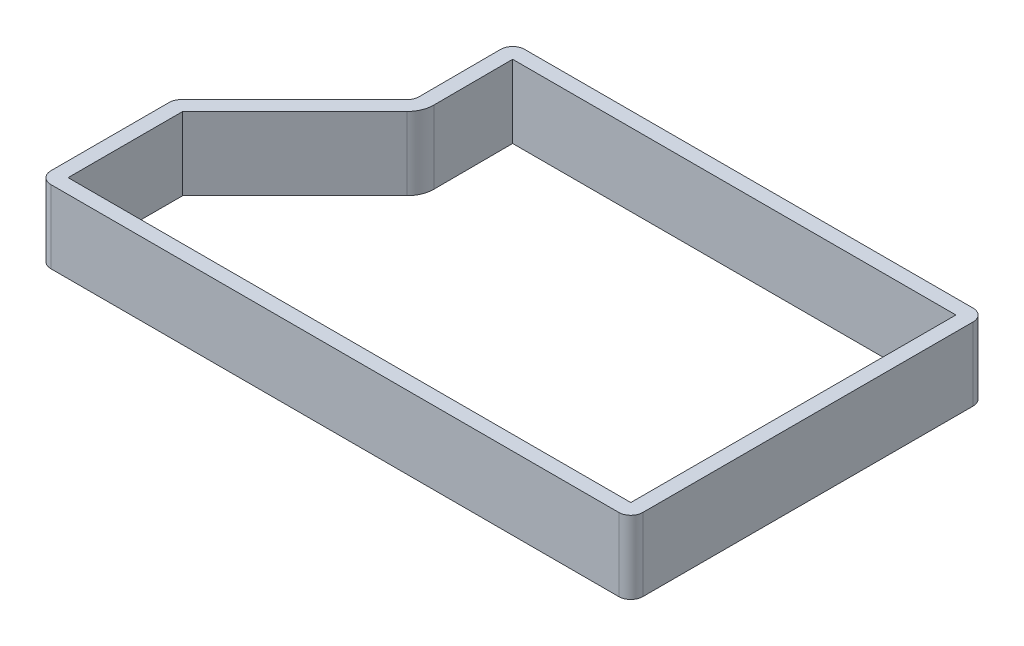
ISO-10303-21;
HEADER;
FILE_DESCRIPTION(('STEP AP214'),'2;1');
FILE_NAME('part.step','',(''),(''),'','','');
FILE_SCHEMA(('AUTOMOTIVE_DESIGN { 1 0 10303 214 1 1 1 1 }'));
ENDSEC;
DATA;
#1=APPLICATION_CONTEXT('core data for automotive mechanical design processes');
#2=APPLICATION_PROTOCOL_DEFINITION('international standard','automotive_design',2000,#1);
#3=PRODUCT_CONTEXT('',#1,'mechanical');
#4=PRODUCT('Part','Part','',(#3));
#5=PRODUCT_RELATED_PRODUCT_CATEGORY('part','',(#4));
#6=PRODUCT_DEFINITION_FORMATION('','',#4);
#7=PRODUCT_DEFINITION_CONTEXT('part definition',#1,'design');
#8=PRODUCT_DEFINITION('design','',#6,#7);
#9=PRODUCT_DEFINITION_SHAPE('','',#8);
#10=(LENGTH_UNIT() NAMED_UNIT(*) SI_UNIT(.MILLI.,.METRE.));
#11=(NAMED_UNIT(*) PLANE_ANGLE_UNIT() SI_UNIT($,.RADIAN.));
#12=(NAMED_UNIT(*) SI_UNIT($,.STERADIAN.) SOLID_ANGLE_UNIT());
#13=UNCERTAINTY_MEASURE_WITH_UNIT(LENGTH_MEASURE(1.E-05),#10,'distance_accuracy_value','');
#14=(GEOMETRIC_REPRESENTATION_CONTEXT(3) GLOBAL_UNCERTAINTY_ASSIGNED_CONTEXT((#13)) GLOBAL_UNIT_ASSIGNED_CONTEXT((#10,
#11,#12)) REPRESENTATION_CONTEXT('',''));
#15=CARTESIAN_POINT('',(0.,0.,0.));
#16=DIRECTION('',(0.,0.,1.));
#17=DIRECTION('',(1.,0.,0.));
#18=AXIS2_PLACEMENT_3D('',#15,#16,#17);
#19=CARTESIAN_POINT('',(-46.4052124173838,10.,20.5894095757332));
#20=DIRECTION('',(0.,1.,0.));
#21=DIRECTION('',(0.,0.,1.));
#22=AXIS2_PLACEMENT_3D('',#19,#20,#21);
#23=PLANE('',#22);
#24=CARTESIAN_POINT('',(-46.4052124173838,10.,20.5894095757332));
#25=DIRECTION('',(0.,1.,0.));
#26=DIRECTION('',(0.,0.,1.));
#27=AXIS2_PLACEMENT_3D('',#24,#25,#26);
#28=CIRCLE('',#27,1.65000064514463);
#29=CARTESIAN_POINT('',(-48.0552130625284,10.,20.5894095757332));
#30=VERTEX_POINT('',#29);
#31=CARTESIAN_POINT('',(-46.4052102955138,10.,22.2394102208765));
#32=VERTEX_POINT('',#31);
#33=EDGE_CURVE('E283',#30,#32,#28,.T.);
#34=ORIENTED_EDGE('',*,*,#33,.T.);
#35=DIRECTION('',(0.999999999999173,0.,-1.28598131570497E-06));
#36=VECTOR('',#35,1.);
#37=CARTESIAN_POINT('',(-46.4052102955138,10.,22.2394102208765));
#38=LINE('',#37,#36);
#39=CARTESIAN_POINT('',(31.4341775141972,10.,22.2393101208781));
#40=VERTEX_POINT('',#39);
#41=EDGE_CURVE('E286',#32,#40,#38,.T.);
#42=ORIENTED_EDGE('',*,*,#41,.T.);
#43=CARTESIAN_POINT('',(31.4341753923272,10.,20.5893094757404));
#44=DIRECTION('',(0.,1.,0.));
#45=DIRECTION('',(0.,0.,1.));
#46=AXIS2_PLACEMENT_3D('',#43,#44,#45);
#47=CIRCLE('',#46,1.65000064513913);
#48=CARTESIAN_POINT('',(33.0841758904115,10.,20.5900060970397));
#49=VERTEX_POINT('',#48);
#50=EDGE_CURVE('E289',#40,#49,#47,.T.);
#51=ORIENTED_EDGE('',*,*,#50,.T.);
#52=DIRECTION('',(0.000422194561797054,0.,-0.999999910875872));
#53=VECTOR('',#52,1.);
#54=CARTESIAN_POINT('',(33.0841758904115,10.,20.5900060970397));
#55=LINE('',#54,#53);
#56=CARTESIAN_POINT('',(33.1032787836854,10.,-24.6566486445435));
#57=VERTEX_POINT('',#56);
#58=EDGE_CURVE('E291',#49,#57,#55,.T.);
#59=ORIENTED_EDGE('',*,*,#58,.T.);
#60=CARTESIAN_POINT('',(31.4532777506671,10.,-24.6573452647848));
#61=DIRECTION('',(0.,1.,0.));
#62=DIRECTION('',(0.,0.,1.));
#63=AXIS2_PLACEMENT_3D('',#60,#61,#62);
#64=CIRCLE('',#63,1.65000118007266);
#65=CARTESIAN_POINT('',(31.4526034062025,10.,-26.3073463070574));
#66=VERTEX_POINT('',#65);
#67=EDGE_CURVE('E293',#57,#66,#64,.T.);
#68=ORIENTED_EDGE('',*,*,#67,.T.);
#69=DIRECTION('',(-0.999999916521232,0.,0.000408604368280507));
#70=VECTOR('',#69,1.);
#71=CARTESIAN_POINT('',(31.4526034062025,10.,-26.3073463070574));
#72=LINE('',#71,#70);
#73=CARTESIAN_POINT('',(-29.9917370350299,10.,-26.2822398790512));
#74=VERTEX_POINT('',#73);
#75=EDGE_CURVE('E295',#66,#74,#72,.T.);
#76=ORIENTED_EDGE('',*,*,#75,.T.);
#77=CARTESIAN_POINT('',(-29.9910628351832,10.,-24.6322335582128));
#78=DIRECTION('',(0.,1.,0.));
#79=DIRECTION('',(0.,0.,1.));
#80=AXIS2_PLACEMENT_3D('',#77,#78,#79);
#81=CIRCLE('',#80,1.65000645857893);
#82=CARTESIAN_POINT('',(-31.6395907625583,10.,-24.7020689791437));
#83=VERTEX_POINT('',#82);
#84=EDGE_CURVE('E297',#74,#83,#81,.T.);
#85=ORIENTED_EDGE('',*,*,#84,.T.);
#86=DIRECTION('',(0.00333069762771936,0.,0.999994453211273));
#87=VECTOR('',#86,1.);
#88=CARTESIAN_POINT('',(-31.6395907625583,10.,-24.7020689791437));
#89=LINE('',#88,#87);
#90=CARTESIAN_POINT('',(-31.6020928625583,10.,-13.4438593791436));
#91=VERTEX_POINT('',#90);
#92=EDGE_CURVE('E299',#83,#91,#89,.T.);
#93=ORIENTED_EDGE('',*,*,#92,.T.);
#94=CARTESIAN_POINT('',(-33.252073423474,10.,-13.4383602646437));
#95=DIRECTION('',(0.,-1.,0.));
#96=DIRECTION('',(0.,0.,1.));
#97=AXIS2_PLACEMENT_3D('',#94,#95,#96);
#98=CIRCLE('',#97,1.64998972471343);
#99=CARTESIAN_POINT('',(-32.085354500241,10.,-12.2716413414107));
#100=VERTEX_POINT('',#99);
#101=EDGE_CURVE('E301',#91,#100,#98,.T.);
#102=ORIENTED_EDGE('',*,*,#101,.T.);
#103=DIRECTION('',(-0.707106781186548,0.,0.707106781186547));
#104=VECTOR('',#103,1.);
#105=CARTESIAN_POINT('',(-32.085354500241,10.,-12.2716413414107));
#106=LINE('',#105,#104);
#107=CARTESIAN_POINT('',(-47.571938463949,10.,3.2149426222973));
#108=VERTEX_POINT('',#107);
#109=EDGE_CURVE('E303',#100,#108,#106,.T.);
#110=ORIENTED_EDGE('',*,*,#109,.T.);
#111=CARTESIAN_POINT('',(-46.405210373708,10.,4.38167071253824));
#112=DIRECTION('',(0.,1.,0.));
#113=DIRECTION('',(0.,0.,1.));
#114=AXIS2_PLACEMENT_3D('',#111,#112,#113);
#115=CIRCLE('',#114,1.6500026888204);
#116=CARTESIAN_POINT('',(-48.0552130625284,10.,4.38167071253824));
#117=VERTEX_POINT('',#116);
#118=EDGE_CURVE('E305',#108,#117,#115,.T.);
#119=ORIENTED_EDGE('',*,*,#118,.T.);
#120=DIRECTION('',(0.,0.,1.));
#121=VECTOR('',#120,1.);
#122=CARTESIAN_POINT('',(-48.0552130625284,10.,4.38167071253824));
#123=LINE('',#122,#121);
#124=EDGE_CURVE('E307',#117,#30,#123,.T.);
#125=ORIENTED_EDGE('',*,*,#124,.T.);
#126=EDGE_LOOP('',(#34,#42,#51,#59,#68,#76,#85,#93,#102,#110,#119,#125));
#127=FACE_BOUND('',#126,.T.);
#128=DIRECTION('',(0.000422194561797054,0.,-0.999999910875872));
#129=VECTOR('',#128,1.);
#130=CARTESIAN_POINT('',(31.0841760686597,10.,20.5891617079161));
#131=LINE('',#130,#129);
#132=CARTESIAN_POINT('',(31.0843237739204,10.,20.2393105707819));
#133=VERTEX_POINT('',#132);
#134=CARTESIAN_POINT('',(31.1031310715185,10.,-24.3072033441654));
#135=VERTEX_POINT('',#134);
#136=EDGE_CURVE('E233',#133,#135,#131,.T.);
#137=ORIENTED_EDGE('',*,*,#136,.F.);
#138=DIRECTION('',(0.999999999999173,0.,-1.28598131570497E-06));
#139=VECTOR('',#138,1.);
#140=CARTESIAN_POINT('',(-46.4052128674764,10.,20.2394102208782));
#141=LINE('',#140,#139);
#142=CARTESIAN_POINT('',(-46.0552130625284,10.,20.2394097707849));
#143=VERTEX_POINT('',#142);
#144=EDGE_CURVE('E225',#143,#133,#141,.T.);
#145=ORIENTED_EDGE('',*,*,#144,.F.);
#146=DIRECTION('',(0.,0.,1.));
#147=VECTOR('',#146,1.);
#148=CARTESIAN_POINT('',(-46.0552130625284,10.,4.38167071253824));
#149=LINE('',#148,#147);
#150=CARTESIAN_POINT('',(-46.0552130625284,10.,4.52664434562294));
#151=VERTEX_POINT('',#150);
#152=EDGE_CURVE('E256',#151,#143,#149,.T.);
#153=ORIENTED_EDGE('',*,*,#152,.F.);
#154=DIRECTION('',(-0.707106781186548,0.,0.707106781186547));
#155=VECTOR('',#154,1.);
#156=CARTESIAN_POINT('',(-30.6711409378679,10.,-10.8574277790376));
#157=LINE('',#156,#155);
#158=CARTESIAN_POINT('',(-30.6711409378679,10.,-10.8574277790376));
#159=VERTEX_POINT('',#158);
#160=EDGE_CURVE('E254',#159,#151,#157,.T.);
#161=ORIENTED_EDGE('',*,*,#160,.F.);
#162=CARTESIAN_POINT('',(-33.252073423474,10.,-13.4383602646437));
#163=DIRECTION('',(0.,1.,0.));
#164=DIRECTION('',(1.,0.,0.));
#165=AXIS2_PLACEMENT_3D('',#162,#163,#164);
#166=CIRCLE('',#165,3.64998972471343);
#167=CARTESIAN_POINT('',(-29.6021039561357,10.,-13.4505207743991));
#168=VERTEX_POINT('',#167);
#169=EDGE_CURVE('E252',#168,#159,#166,.F.);
#170=ORIENTED_EDGE('',*,*,#169,.F.);
#171=DIRECTION('',(0.00333069762771936,0.,0.999994453211273));
#172=VECTOR('',#171,1.);
#173=CARTESIAN_POINT('',(-29.6396018561358,10.,-24.7087303743991));
#174=LINE('',#173,#172);
#175=CARTESIAN_POINT('',(-29.6381818179885,10.,-24.2823841763118));
#176=VERTEX_POINT('',#175);
#177=EDGE_CURVE('E248',#176,#168,#174,.T.);
#178=ORIENTED_EDGE('',*,*,#177,.F.);
#179=DIRECTION('',(-0.999999916521232,0.,0.000408604368280507));
#180=VECTOR('',#179,1.);
#181=CARTESIAN_POINT('',(31.4534206149391,10.,-24.307346474015));
#182=LINE('',#181,#180);
#183=EDGE_CURVE('E246',#135,#176,#182,.T.);
#184=ORIENTED_EDGE('',*,*,#183,.F.);
#185=EDGE_LOOP('',(#137,#145,#153,#161,#170,#178,#184));
#186=FACE_BOUND('',#185,.T.);
#187=ADVANCED_FACE('F94',(#127,#186),#23,.T.);
#188=CARTESIAN_POINT('',(-46.4052124173838,0.,20.5894095757332));
#189=DIRECTION('',(0.,1.,0.));
#190=DIRECTION('',(0.,0.,1.));
#191=AXIS2_PLACEMENT_3D('',#188,#189,#190);
#192=PLANE('',#191);
#193=CARTESIAN_POINT('',(-46.4052124173838,0.,20.5894095757332));
#194=DIRECTION('',(0.,1.,0.));
#195=DIRECTION('',(0.,0.,1.));
#196=AXIS2_PLACEMENT_3D('',#193,#194,#195);
#197=CIRCLE('',#196,1.65000064514463);
#198=CARTESIAN_POINT('',(-48.0552130625284,0.,20.5894095757332));
#199=VERTEX_POINT('',#198);
#200=CARTESIAN_POINT('',(-46.4052102955138,0.,22.2394102208765));
#201=VERTEX_POINT('',#200);
#202=EDGE_CURVE('E241',#199,#201,#197,.T.);
#203=ORIENTED_EDGE('',*,*,#202,.F.);
#204=DIRECTION('',(0.,0.,1.));
#205=VECTOR('',#204,1.);
#206=CARTESIAN_POINT('',(-48.0552130625284,0.,4.38167071253824));
#207=LINE('',#206,#205);
#208=CARTESIAN_POINT('',(-48.0552130625284,0.,4.38167071253824));
#209=VERTEX_POINT('',#208);
#210=EDGE_CURVE('E287',#209,#199,#207,.T.);
#211=ORIENTED_EDGE('',*,*,#210,.F.);
#212=CARTESIAN_POINT('',(-46.405210373708,0.,4.38167071253824));
#213=DIRECTION('',(0.,1.,0.));
#214=DIRECTION('',(0.,0.,1.));
#215=AXIS2_PLACEMENT_3D('',#212,#213,#214);
#216=CIRCLE('',#215,1.6500026888204);
#217=CARTESIAN_POINT('',(-47.571938463949,0.,3.2149426222973));
#218=VERTEX_POINT('',#217);
#219=EDGE_CURVE('E330',#218,#209,#216,.T.);
#220=ORIENTED_EDGE('',*,*,#219,.F.);
#221=DIRECTION('',(-0.707106781186548,0.,0.707106781186547));
#222=VECTOR('',#221,1.);
#223=CARTESIAN_POINT('',(-32.085354500241,0.,-12.2716413414107));
#224=LINE('',#223,#222);
#225=CARTESIAN_POINT('',(-32.085354500241,0.,-12.2716413414107));
#226=VERTEX_POINT('',#225);
#227=EDGE_CURVE('E328',#226,#218,#224,.T.);
#228=ORIENTED_EDGE('',*,*,#227,.F.);
#229=CARTESIAN_POINT('',(-33.252073423474,0.,-13.4383602646437));
#230=DIRECTION('',(0.,-1.,0.));
#231=DIRECTION('',(0.,0.,1.));
#232=AXIS2_PLACEMENT_3D('',#229,#230,#231);
#233=CIRCLE('',#232,1.64998972471343);
#234=CARTESIAN_POINT('',(-31.6020928625583,0.,-13.4438593791436));
#235=VERTEX_POINT('',#234);
#236=EDGE_CURVE('E326',#235,#226,#233,.T.);
#237=ORIENTED_EDGE('',*,*,#236,.F.);
#238=DIRECTION('',(0.00333069762771936,0.,0.999994453211273));
#239=VECTOR('',#238,1.);
#240=CARTESIAN_POINT('',(-31.6395907625583,0.,-24.7020689791437));
#241=LINE('',#240,#239);
#242=CARTESIAN_POINT('',(-31.6395907625583,0.,-24.7020689791437));
#243=VERTEX_POINT('',#242);
#244=EDGE_CURVE('E324',#243,#235,#241,.T.);
#245=ORIENTED_EDGE('',*,*,#244,.F.);
#246=CARTESIAN_POINT('',(-29.9910628351832,0.,-24.6322335582128));
#247=DIRECTION('',(0.,1.,0.));
#248=DIRECTION('',(0.,0.,1.));
#249=AXIS2_PLACEMENT_3D('',#246,#247,#248);
#250=CIRCLE('',#249,1.65000645857893);
#251=CARTESIAN_POINT('',(-29.9917370350299,0.,-26.2822398790512));
#252=VERTEX_POINT('',#251);
#253=EDGE_CURVE('E322',#252,#243,#250,.T.);
#254=ORIENTED_EDGE('',*,*,#253,.F.);
#255=DIRECTION('',(-0.999999916521232,0.,0.000408604368280507));
#256=VECTOR('',#255,1.);
#257=CARTESIAN_POINT('',(31.4526034062025,0.,-26.3073463070574));
#258=LINE('',#257,#256);
#259=CARTESIAN_POINT('',(31.4526034062025,0.,-26.3073463070574));
#260=VERTEX_POINT('',#259);
#261=EDGE_CURVE('E320',#260,#252,#258,.T.);
#262=ORIENTED_EDGE('',*,*,#261,.F.);
#263=CARTESIAN_POINT('',(31.4532777506671,0.,-24.6573452647848));
#264=DIRECTION('',(0.,1.,0.));
#265=DIRECTION('',(0.,0.,1.));
#266=AXIS2_PLACEMENT_3D('',#263,#264,#265);
#267=CIRCLE('',#266,1.65000118007266);
#268=CARTESIAN_POINT('',(33.1032787836854,0.,-24.6566486445435));
#269=VERTEX_POINT('',#268);
#270=EDGE_CURVE('E318',#269,#260,#267,.T.);
#271=ORIENTED_EDGE('',*,*,#270,.F.);
#272=DIRECTION('',(0.000422194561797054,0.,-0.999999910875872));
#273=VECTOR('',#272,1.);
#274=CARTESIAN_POINT('',(33.0841758904115,0.,20.5900060970397));
#275=LINE('',#274,#273);
#276=CARTESIAN_POINT('',(33.0841758904115,0.,20.5900060970397));
#277=VERTEX_POINT('',#276);
#278=EDGE_CURVE('E316',#277,#269,#275,.T.);
#279=ORIENTED_EDGE('',*,*,#278,.F.);
#280=CARTESIAN_POINT('',(31.4341753923272,0.,20.5893094757404));
#281=DIRECTION('',(0.,1.,0.));
#282=DIRECTION('',(0.,0.,1.));
#283=AXIS2_PLACEMENT_3D('',#280,#281,#282);
#284=CIRCLE('',#283,1.65000064513913);
#285=CARTESIAN_POINT('',(31.4341775141972,0.,22.2393101208781));
#286=VERTEX_POINT('',#285);
#287=EDGE_CURVE('E314',#286,#277,#284,.T.);
#288=ORIENTED_EDGE('',*,*,#287,.F.);
#289=DIRECTION('',(0.999999999999173,0.,-1.28598131570497E-06));
#290=VECTOR('',#289,1.);
#291=CARTESIAN_POINT('',(-46.4052102955138,0.,22.2394102208765));
#292=LINE('',#291,#290);
#293=EDGE_CURVE('E312',#201,#286,#292,.T.);
#294=ORIENTED_EDGE('',*,*,#293,.F.);
#295=EDGE_LOOP('',(#203,#211,#220,#228,#237,#245,#254,#262,#271,#279,#288,#294));
#296=FACE_BOUND('',#295,.T.);
#297=DIRECTION('',(0.999999999999173,0.,-1.28598131570497E-06));
#298=VECTOR('',#297,1.);
#299=CARTESIAN_POINT('',(-46.4052128674764,0.,20.2394102208782));
#300=LINE('',#299,#298);
#301=CARTESIAN_POINT('',(-46.0552130625284,0.,20.2394097707849));
#302=VERTEX_POINT('',#301);
#303=CARTESIAN_POINT('',(31.0843237739204,0.,20.2393105707819));
#304=VERTEX_POINT('',#303);
#305=EDGE_CURVE('E117',#302,#304,#300,.T.);
#306=ORIENTED_EDGE('',*,*,#305,.T.);
#307=DIRECTION('',(0.000422194561797054,0.,-0.999999910875872));
#308=VECTOR('',#307,1.);
#309=CARTESIAN_POINT('',(31.0841760686597,0.,20.5891617079161));
#310=LINE('',#309,#308);
#311=CARTESIAN_POINT('',(31.1031310715185,0.,-24.3072033441654));
#312=VERTEX_POINT('',#311);
#313=EDGE_CURVE('E240',#304,#312,#310,.T.);
#314=ORIENTED_EDGE('',*,*,#313,.T.);
#315=DIRECTION('',(-0.999999916521232,0.,0.000408604368280507));
#316=VECTOR('',#315,1.);
#317=CARTESIAN_POINT('',(31.4534206149391,0.,-24.307346474015));
#318=LINE('',#317,#316);
#319=CARTESIAN_POINT('',(-29.6381818179885,0.,-24.2823841763118));
#320=VERTEX_POINT('',#319);
#321=EDGE_CURVE('E260',#312,#320,#318,.T.);
#322=ORIENTED_EDGE('',*,*,#321,.T.);
#323=DIRECTION('',(0.00333069762771936,0.,0.999994453211273));
#324=VECTOR('',#323,1.);
#325=CARTESIAN_POINT('',(-29.6396018561358,0.,-24.7087303743991));
#326=LINE('',#325,#324);
#327=CARTESIAN_POINT('',(-29.6021039561357,0.,-13.4505207743991));
#328=VERTEX_POINT('',#327);
#329=EDGE_CURVE('E263',#320,#328,#326,.T.);
#330=ORIENTED_EDGE('',*,*,#329,.T.);
#331=CARTESIAN_POINT('',(-33.252073423474,0.,-13.4383602646437));
#332=DIRECTION('',(0.,1.,0.));
#333=DIRECTION('',(1.,0.,0.));
#334=AXIS2_PLACEMENT_3D('',#331,#332,#333);
#335=CIRCLE('',#334,3.64998972471343);
#336=CARTESIAN_POINT('',(-30.6711409378679,0.,-10.8574277790376));
#337=VERTEX_POINT('',#336);
#338=EDGE_CURVE('E266',#328,#337,#335,.F.);
#339=ORIENTED_EDGE('',*,*,#338,.T.);
#340=DIRECTION('',(-0.707106781186548,0.,0.707106781186547));
#341=VECTOR('',#340,1.);
#342=CARTESIAN_POINT('',(-30.6711409378679,0.,-10.8574277790376));
#343=LINE('',#342,#341);
#344=CARTESIAN_POINT('',(-46.0552130625284,0.,4.52664434562294));
#345=VERTEX_POINT('',#344);
#346=EDGE_CURVE('E269',#337,#345,#343,.T.);
#347=ORIENTED_EDGE('',*,*,#346,.T.);
#348=DIRECTION('',(0.,0.,1.));
#349=VECTOR('',#348,1.);
#350=CARTESIAN_POINT('',(-46.0552130625284,0.,4.38167071253824));
#351=LINE('',#350,#349);
#352=EDGE_CURVE('E234',#345,#302,#351,.T.);
#353=ORIENTED_EDGE('',*,*,#352,.T.);
#354=EDGE_LOOP('',(#306,#314,#322,#330,#339,#347,#353));
#355=FACE_BOUND('',#354,.T.);
#356=ADVANCED_FACE('F372',(#296,#355),#192,.F.);
#357=CARTESIAN_POINT('',(-46.4052124173838,10.,20.5894095757332));
#358=DIRECTION('',(0.,-1.,0.));
#359=DIRECTION('',(0.,0.,-1.));
#360=AXIS2_PLACEMENT_3D('',#357,#358,#359);
#361=CYLINDRICAL_SURFACE('',#360,1.65000064514463);
#362=ORIENTED_EDGE('',*,*,#202,.T.);
#363=DIRECTION('',(0.,-1.,0.));
#364=VECTOR('',#363,1.);
#365=CARTESIAN_POINT('',(-46.4052102955138,10.,22.2394102208765));
#366=LINE('',#365,#364);
#367=EDGE_CURVE('E12',#32,#201,#366,.T.);
#368=ORIENTED_EDGE('',*,*,#367,.F.);
#369=ORIENTED_EDGE('',*,*,#33,.F.);
#370=DIRECTION('',(0.,-1.,0.));
#371=VECTOR('',#370,1.);
#372=CARTESIAN_POINT('',(-48.0552130625284,10.,20.5894095757332));
#373=LINE('',#372,#371);
#374=EDGE_CURVE('E309',#30,#199,#373,.T.);
#375=ORIENTED_EDGE('',*,*,#374,.T.);
#376=EDGE_LOOP('',(#362,#368,#369,#375));
#377=FACE_BOUND('',#376,.T.);
#378=ADVANCED_FACE('F96',(#377),#361,.T.);
#379=CARTESIAN_POINT('',(-46.4052102955138,10.,22.2394102208765));
#380=DIRECTION('',(-1.28598131570497E-06,0.,-0.999999999999173));
#381=DIRECTION('',(-0.999999999999173,0.,1.28598131570497E-06));
#382=AXIS2_PLACEMENT_3D('',#379,#380,#381);
#383=PLANE('',#382);
#384=ORIENTED_EDGE('',*,*,#293,.T.);
#385=DIRECTION('',(0.,-1.,0.));
#386=VECTOR('',#385,1.);
#387=CARTESIAN_POINT('',(31.4341775141972,10.,22.2393101208781));
#388=LINE('',#387,#386);
#389=EDGE_CURVE('E102',#40,#286,#388,.T.);
#390=ORIENTED_EDGE('',*,*,#389,.F.);
#391=ORIENTED_EDGE('',*,*,#41,.F.);
#392=ORIENTED_EDGE('',*,*,#367,.T.);
#393=EDGE_LOOP('',(#384,#390,#391,#392));
#394=FACE_BOUND('',#393,.T.);
#395=ADVANCED_FACE('F389',(#394),#383,.F.);
#396=CARTESIAN_POINT('',(31.4341753923272,10.,20.5893094757404));
#397=DIRECTION('',(0.,-1.,0.));
#398=DIRECTION('',(0.,0.,-1.));
#399=AXIS2_PLACEMENT_3D('',#396,#397,#398);
#400=CYLINDRICAL_SURFACE('',#399,1.65000064513913);
#401=ORIENTED_EDGE('',*,*,#287,.T.);
#402=DIRECTION('',(0.,-1.,0.));
#403=VECTOR('',#402,1.);
#404=CARTESIAN_POINT('',(33.0841758904115,10.,20.5900060970397));
#405=LINE('',#404,#403);
#406=EDGE_CURVE('E359',#49,#277,#405,.T.);
#407=ORIENTED_EDGE('',*,*,#406,.F.);
#408=ORIENTED_EDGE('',*,*,#50,.F.);
#409=ORIENTED_EDGE('',*,*,#389,.T.);
#410=EDGE_LOOP('',(#401,#407,#408,#409));
#411=FACE_BOUND('',#410,.T.);
#412=ADVANCED_FACE('F366',(#411),#400,.T.);
#413=CARTESIAN_POINT('',(33.0841758904115,10.,20.5900060970397));
#414=DIRECTION('',(-0.999999910875872,0.,-0.000422194561797053));
#415=DIRECTION('',(-0.000422194561797054,0.,0.999999910875872));
#416=AXIS2_PLACEMENT_3D('',#413,#414,#415);
#417=PLANE('',#416);
#418=ORIENTED_EDGE('',*,*,#278,.T.);
#419=DIRECTION('',(0.,-1.,0.));
#420=VECTOR('',#419,1.);
#421=CARTESIAN_POINT('',(33.1032787836854,10.,-24.6566486445435));
#422=LINE('',#421,#420);
#423=EDGE_CURVE('E356',#57,#269,#422,.T.);
#424=ORIENTED_EDGE('',*,*,#423,.F.);
#425=ORIENTED_EDGE('',*,*,#58,.F.);
#426=ORIENTED_EDGE('',*,*,#406,.T.);
#427=EDGE_LOOP('',(#418,#424,#425,#426));
#428=FACE_BOUND('',#427,.T.);
#429=ADVANCED_FACE('F378',(#428),#417,.F.);
#430=CARTESIAN_POINT('',(31.4532777506671,10.,-24.6573452647848));
#431=DIRECTION('',(0.,-1.,0.));
#432=DIRECTION('',(0.,0.,-1.));
#433=AXIS2_PLACEMENT_3D('',#430,#431,#432);
#434=CYLINDRICAL_SURFACE('',#433,1.65000118007266);
#435=ORIENTED_EDGE('',*,*,#270,.T.);
#436=DIRECTION('',(0.,-1.,0.));
#437=VECTOR('',#436,1.);
#438=CARTESIAN_POINT('',(31.4526034062025,10.,-26.3073463070574));
#439=LINE('',#438,#437);
#440=EDGE_CURVE('E353',#66,#260,#439,.T.);
#441=ORIENTED_EDGE('',*,*,#440,.F.);
#442=ORIENTED_EDGE('',*,*,#67,.F.);
#443=ORIENTED_EDGE('',*,*,#423,.T.);
#444=EDGE_LOOP('',(#435,#441,#442,#443));
#445=FACE_BOUND('',#444,.T.);
#446=ADVANCED_FACE('F382',(#445),#434,.T.);
#447=CARTESIAN_POINT('',(31.4526034062025,10.,-26.3073463070574));
#448=DIRECTION('',(0.000408604368280507,0.,0.999999916521232));
#449=DIRECTION('',(0.999999916521232,0.,-0.000408604368280507));
#450=AXIS2_PLACEMENT_3D('',#447,#448,#449);
#451=PLANE('',#450);
#452=ORIENTED_EDGE('',*,*,#261,.T.);
#453=DIRECTION('',(0.,-1.,0.));
#454=VECTOR('',#453,1.);
#455=CARTESIAN_POINT('',(-29.9917370350299,10.,-26.2822398790512));
#456=LINE('',#455,#454);
#457=EDGE_CURVE('E350',#74,#252,#456,.T.);
#458=ORIENTED_EDGE('',*,*,#457,.F.);
#459=ORIENTED_EDGE('',*,*,#75,.F.);
#460=ORIENTED_EDGE('',*,*,#440,.T.);
#461=EDGE_LOOP('',(#452,#458,#459,#460));
#462=FACE_BOUND('',#461,.T.);
#463=ADVANCED_FACE('F422',(#462),#451,.F.);
#464=CARTESIAN_POINT('',(-29.9910628351832,10.,-24.6322335582128));
#465=DIRECTION('',(0.,-1.,0.));
#466=DIRECTION('',(0.,0.,-1.));
#467=AXIS2_PLACEMENT_3D('',#464,#465,#466);
#468=CYLINDRICAL_SURFACE('',#467,1.65000645857893);
#469=ORIENTED_EDGE('',*,*,#253,.T.);
#470=DIRECTION('',(0.,-1.,0.));
#471=VECTOR('',#470,1.);
#472=CARTESIAN_POINT('',(-31.6395907625583,10.,-24.7020689791437));
#473=LINE('',#472,#471);
#474=EDGE_CURVE('E347',#83,#243,#473,.T.);
#475=ORIENTED_EDGE('',*,*,#474,.F.);
#476=ORIENTED_EDGE('',*,*,#84,.F.);
#477=ORIENTED_EDGE('',*,*,#457,.T.);
#478=EDGE_LOOP('',(#469,#475,#476,#477));
#479=FACE_BOUND('',#478,.T.);
#480=ADVANCED_FACE('F420',(#479),#468,.T.);
#481=CARTESIAN_POINT('',(-31.6395907625583,10.,-24.7020689791437));
#482=DIRECTION('',(0.999994453211273,0.,-0.00333069762771936));
#483=DIRECTION('',(-0.00333069762771936,0.,-0.999994453211273));
#484=AXIS2_PLACEMENT_3D('',#481,#482,#483);
#485=PLANE('',#484);
#486=ORIENTED_EDGE('',*,*,#244,.T.);
#487=DIRECTION('',(0.,-1.,0.));
#488=VECTOR('',#487,1.);
#489=CARTESIAN_POINT('',(-31.6020928625583,10.,-13.4438593791436));
#490=LINE('',#489,#488);
#491=EDGE_CURVE('E344',#91,#235,#490,.T.);
#492=ORIENTED_EDGE('',*,*,#491,.F.);
#493=ORIENTED_EDGE('',*,*,#92,.F.);
#494=ORIENTED_EDGE('',*,*,#474,.T.);
#495=EDGE_LOOP('',(#486,#492,#493,#494));
#496=FACE_BOUND('',#495,.T.);
#497=ADVANCED_FACE('F416',(#496),#485,.F.);
#498=CARTESIAN_POINT('',(-33.252073423474,10.,-13.4383602646437));
#499=DIRECTION('',(0.,-1.,0.));
#500=DIRECTION('',(0.,0.,-1.));
#501=AXIS2_PLACEMENT_3D('',#498,#499,#500);
#502=CYLINDRICAL_SURFACE('',#501,1.64998972471343);
#503=ORIENTED_EDGE('',*,*,#236,.T.);
#504=DIRECTION('',(0.,-1.,0.));
#505=VECTOR('',#504,1.);
#506=CARTESIAN_POINT('',(-32.085354500241,10.,-12.2716413414107));
#507=LINE('',#506,#505);
#508=EDGE_CURVE('E341',#100,#226,#507,.T.);
#509=ORIENTED_EDGE('',*,*,#508,.F.);
#510=ORIENTED_EDGE('',*,*,#101,.F.);
#511=ORIENTED_EDGE('',*,*,#491,.T.);
#512=EDGE_LOOP('',(#503,#509,#510,#511));
#513=FACE_BOUND('',#512,.T.);
#514=ADVANCED_FACE('F411',(#513),#502,.F.);
#515=CARTESIAN_POINT('',(-32.085354500241,10.,-12.2716413414107));
#516=DIRECTION('',(0.707106781186547,0.,0.707106781186548));
#517=DIRECTION('',(0.707106781186548,0.,-0.707106781186547));
#518=AXIS2_PLACEMENT_3D('',#515,#516,#517);
#519=PLANE('',#518);
#520=ORIENTED_EDGE('',*,*,#227,.T.);
#521=DIRECTION('',(0.,-1.,0.));
#522=VECTOR('',#521,1.);
#523=CARTESIAN_POINT('',(-47.571938463949,10.,3.2149426222973));
#524=LINE('',#523,#522);
#525=EDGE_CURVE('E338',#108,#218,#524,.T.);
#526=ORIENTED_EDGE('',*,*,#525,.F.);
#527=ORIENTED_EDGE('',*,*,#109,.F.);
#528=ORIENTED_EDGE('',*,*,#508,.T.);
#529=EDGE_LOOP('',(#520,#526,#527,#528));
#530=FACE_BOUND('',#529,.T.);
#531=ADVANCED_FACE('F405',(#530),#519,.F.);
#532=CARTESIAN_POINT('',(-46.405210373708,10.,4.38167071253824));
#533=DIRECTION('',(0.,-1.,0.));
#534=DIRECTION('',(0.,0.,-1.));
#535=AXIS2_PLACEMENT_3D('',#532,#533,#534);
#536=CYLINDRICAL_SURFACE('',#535,1.6500026888204);
#537=ORIENTED_EDGE('',*,*,#219,.T.);
#538=DIRECTION('',(0.,-1.,0.));
#539=VECTOR('',#538,1.);
#540=CARTESIAN_POINT('',(-48.0552130625284,10.,4.38167071253824));
#541=LINE('',#540,#539);
#542=EDGE_CURVE('E335',#117,#209,#541,.T.);
#543=ORIENTED_EDGE('',*,*,#542,.F.);
#544=ORIENTED_EDGE('',*,*,#118,.F.);
#545=ORIENTED_EDGE('',*,*,#525,.T.);
#546=EDGE_LOOP('',(#537,#543,#544,#545));
#547=FACE_BOUND('',#546,.T.);
#548=ADVANCED_FACE('F401',(#547),#536,.T.);
#549=CARTESIAN_POINT('',(-48.0552130625284,10.,4.38167071253824));
#550=DIRECTION('',(1.,0.,0.));
#551=DIRECTION('',(0.,0.,-1.));
#552=AXIS2_PLACEMENT_3D('',#549,#550,#551);
#553=PLANE('',#552);
#554=ORIENTED_EDGE('',*,*,#210,.T.);
#555=ORIENTED_EDGE('',*,*,#374,.F.);
#556=ORIENTED_EDGE('',*,*,#124,.F.);
#557=ORIENTED_EDGE('',*,*,#542,.T.);
#558=EDGE_LOOP('',(#554,#555,#556,#557));
#559=FACE_BOUND('',#558,.T.);
#560=ADVANCED_FACE('F396',(#559),#553,.F.);
#561=CARTESIAN_POINT('',(-46.4052128674764,10.,20.2394102208782));
#562=DIRECTION('',(-1.28598131570497E-06,0.,-0.999999999999173));
#563=DIRECTION('',(-0.999999999999173,0.,1.28598131570497E-06));
#564=AXIS2_PLACEMENT_3D('',#561,#562,#563);
#565=PLANE('',#564);
#566=ORIENTED_EDGE('',*,*,#305,.F.);
#567=DIRECTION('',(0.,-1.,0.));
#568=VECTOR('',#567,1.);
#569=CARTESIAN_POINT('',(-46.0552130625284,10.,20.2394097707849));
#570=LINE('',#569,#568);
#571=EDGE_CURVE('E229',#143,#302,#570,.T.);
#572=ORIENTED_EDGE('',*,*,#571,.F.);
#573=ORIENTED_EDGE('',*,*,#144,.T.);
#574=DIRECTION('',(0.,-1.,0.));
#575=VECTOR('',#574,1.);
#576=CARTESIAN_POINT('',(31.0843237739204,10.,20.2393105707819));
#577=LINE('',#576,#575);
#578=EDGE_CURVE('E228',#133,#304,#577,.T.);
#579=ORIENTED_EDGE('',*,*,#578,.T.);
#580=EDGE_LOOP('',(#566,#572,#573,#579));
#581=FACE_BOUND('',#580,.T.);
#582=ADVANCED_FACE('F227',(#581),#565,.T.);
#583=CARTESIAN_POINT('',(31.0841760686597,10.,20.5891617079161));
#584=DIRECTION('',(-0.999999910875872,0.,-0.000422194561797054));
#585=DIRECTION('',(-0.000422194561797054,0.,0.999999910875872));
#586=AXIS2_PLACEMENT_3D('',#583,#584,#585);
#587=PLANE('',#586);
#588=ORIENTED_EDGE('',*,*,#313,.F.);
#589=ORIENTED_EDGE('',*,*,#578,.F.);
#590=ORIENTED_EDGE('',*,*,#136,.T.);
#591=DIRECTION('',(0.,-1.,0.));
#592=VECTOR('',#591,1.);
#593=CARTESIAN_POINT('',(31.1031310715185,10.,-24.3072033441654));
#594=LINE('',#593,#592);
#595=EDGE_CURVE('E242',#135,#312,#594,.T.);
#596=ORIENTED_EDGE('',*,*,#595,.T.);
#597=EDGE_LOOP('',(#588,#589,#590,#596));
#598=FACE_BOUND('',#597,.T.);
#599=ADVANCED_FACE('F237',(#598),#587,.T.);
#600=CARTESIAN_POINT('',(31.4534206149391,10.,-24.307346474015));
#601=DIRECTION('',(0.000408604368280507,0.,0.999999916521232));
#602=DIRECTION('',(0.999999916521232,0.,-0.000408604368280507));
#603=AXIS2_PLACEMENT_3D('',#600,#601,#602);
#604=PLANE('',#603);
#605=ORIENTED_EDGE('',*,*,#321,.F.);
#606=ORIENTED_EDGE('',*,*,#595,.F.);
#607=ORIENTED_EDGE('',*,*,#183,.T.);
#608=DIRECTION('',(0.,-1.,0.));
#609=VECTOR('',#608,1.);
#610=CARTESIAN_POINT('',(-29.6381818179885,10.,-24.2823841763118));
#611=LINE('',#610,#609);
#612=EDGE_CURVE('E280',#176,#320,#611,.T.);
#613=ORIENTED_EDGE('',*,*,#612,.T.);
#614=EDGE_LOOP('',(#605,#606,#607,#613));
#615=FACE_BOUND('',#614,.T.);
#616=ADVANCED_FACE('F480',(#615),#604,.T.);
#617=CARTESIAN_POINT('',(-29.6396018561358,10.,-24.7087303743991));
#618=DIRECTION('',(0.999994453211273,0.,-0.00333069762771936));
#619=DIRECTION('',(-0.00333069762771936,0.,-0.999994453211273));
#620=AXIS2_PLACEMENT_3D('',#617,#618,#619);
#621=PLANE('',#620);
#622=ORIENTED_EDGE('',*,*,#329,.F.);
#623=ORIENTED_EDGE('',*,*,#612,.F.);
#624=ORIENTED_EDGE('',*,*,#177,.T.);
#625=DIRECTION('',(0.,-1.,0.));
#626=VECTOR('',#625,1.);
#627=CARTESIAN_POINT('',(-29.6021039561357,10.,-13.4505207743991));
#628=LINE('',#627,#626);
#629=EDGE_CURVE('E278',#168,#328,#628,.T.);
#630=ORIENTED_EDGE('',*,*,#629,.T.);
#631=EDGE_LOOP('',(#622,#623,#624,#630));
#632=FACE_BOUND('',#631,.T.);
#633=ADVANCED_FACE('F486',(#632),#621,.T.);
#634=CARTESIAN_POINT('',(-33.252073423474,10.,-13.4383602646437));
#635=DIRECTION('',(0.,-1.,0.));
#636=DIRECTION('',(0.,0.,-1.));
#637=AXIS2_PLACEMENT_3D('',#634,#635,#636);
#638=CYLINDRICAL_SURFACE('',#637,3.64998972471343);
#639=ORIENTED_EDGE('',*,*,#338,.F.);
#640=ORIENTED_EDGE('',*,*,#629,.F.);
#641=ORIENTED_EDGE('',*,*,#169,.T.);
#642=DIRECTION('',(0.,-1.,0.));
#643=VECTOR('',#642,1.);
#644=CARTESIAN_POINT('',(-30.6711409378679,10.,-10.8574277790376));
#645=LINE('',#644,#643);
#646=EDGE_CURVE('E276',#159,#337,#645,.T.);
#647=ORIENTED_EDGE('',*,*,#646,.T.);
#648=EDGE_LOOP('',(#639,#640,#641,#647));
#649=FACE_BOUND('',#648,.T.);
#650=ADVANCED_FACE('F494',(#649),#638,.T.);
#651=CARTESIAN_POINT('',(-30.6711409378679,10.,-10.8574277790376));
#652=DIRECTION('',(0.707106781186547,0.,0.707106781186548));
#653=DIRECTION('',(0.707106781186548,0.,-0.707106781186547));
#654=AXIS2_PLACEMENT_3D('',#651,#652,#653);
#655=PLANE('',#654);
#656=ORIENTED_EDGE('',*,*,#346,.F.);
#657=ORIENTED_EDGE('',*,*,#646,.F.);
#658=ORIENTED_EDGE('',*,*,#160,.T.);
#659=DIRECTION('',(0.,-1.,0.));
#660=VECTOR('',#659,1.);
#661=CARTESIAN_POINT('',(-46.0552130625284,10.,4.52664434562294));
#662=LINE('',#661,#660);
#663=EDGE_CURVE('E109',#151,#345,#662,.T.);
#664=ORIENTED_EDGE('',*,*,#663,.T.);
#665=EDGE_LOOP('',(#656,#657,#658,#664));
#666=FACE_BOUND('',#665,.T.);
#667=ADVANCED_FACE('F502',(#666),#655,.T.);
#668=CARTESIAN_POINT('',(-46.0552130625284,10.,4.38167071253824));
#669=DIRECTION('',(1.,0.,0.));
#670=DIRECTION('',(0.,0.,-1.));
#671=AXIS2_PLACEMENT_3D('',#668,#669,#670);
#672=PLANE('',#671);
#673=ORIENTED_EDGE('',*,*,#352,.F.);
#674=ORIENTED_EDGE('',*,*,#663,.F.);
#675=ORIENTED_EDGE('',*,*,#152,.T.);
#676=ORIENTED_EDGE('',*,*,#571,.T.);
#677=EDGE_LOOP('',(#673,#674,#675,#676));
#678=FACE_BOUND('',#677,.T.);
#679=ADVANCED_FACE('F510',(#678),#672,.T.);
#680=CLOSED_SHELL('',(#187,#356,#378,#395,#412,#429,#446,#463,#480,#497,#514,#531,#548,#560,
#582,#599,#616,#633,#650,#667,#679));
#681=MANIFOLD_SOLID_BREP('B2',#680);
#682=ADVANCED_BREP_SHAPE_REPRESENTATION('',(#18,#681),#14);
#683=SHAPE_DEFINITION_REPRESENTATION(#9,#682);
ENDSEC;
END-ISO-10303-21;
